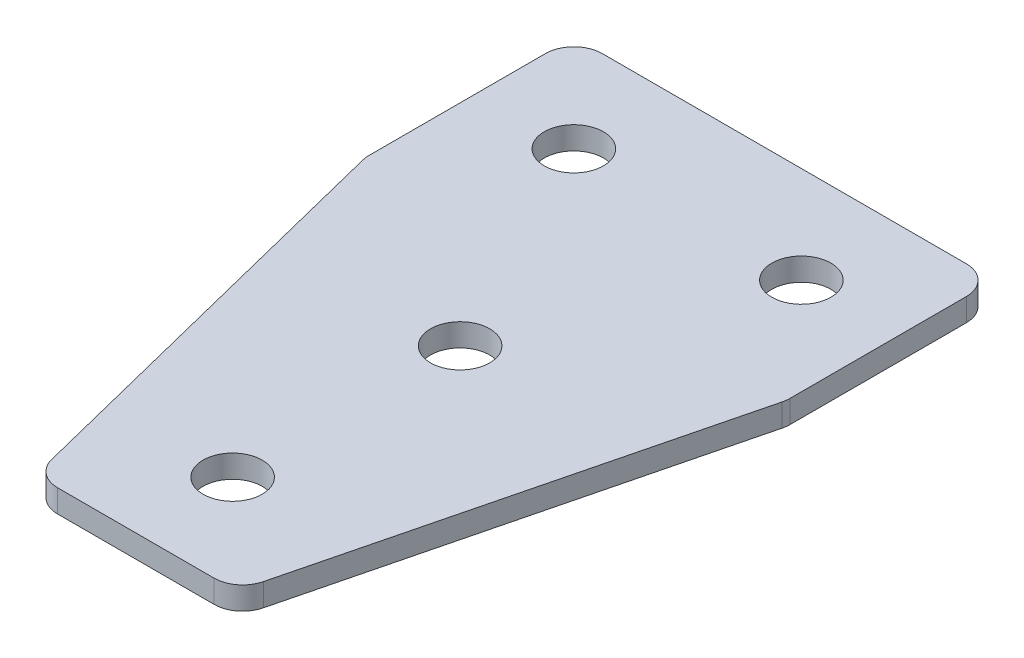
ISO-10303-21;
HEADER;
FILE_DESCRIPTION(('STEP AP214'),'2;1');
FILE_NAME('part.step','',(''),(''),'','','');
FILE_SCHEMA(('AUTOMOTIVE_DESIGN { 1 0 10303 214 1 1 1 1 }'));
ENDSEC;
DATA;
#1=APPLICATION_CONTEXT('core data for automotive mechanical design processes');
#2=APPLICATION_PROTOCOL_DEFINITION('international standard','automotive_design',2000,#1);
#3=PRODUCT_CONTEXT('',#1,'mechanical');
#4=PRODUCT('Part','Part','',(#3));
#5=PRODUCT_RELATED_PRODUCT_CATEGORY('part','',(#4));
#6=PRODUCT_DEFINITION_FORMATION('','',#4);
#7=PRODUCT_DEFINITION_CONTEXT('part definition',#1,'design');
#8=PRODUCT_DEFINITION('design','',#6,#7);
#9=PRODUCT_DEFINITION_SHAPE('','',#8);
#10=(LENGTH_UNIT() NAMED_UNIT(*) SI_UNIT(.MILLI.,.METRE.));
#11=(NAMED_UNIT(*) PLANE_ANGLE_UNIT() SI_UNIT($,.RADIAN.));
#12=(NAMED_UNIT(*) SI_UNIT($,.STERADIAN.) SOLID_ANGLE_UNIT());
#13=UNCERTAINTY_MEASURE_WITH_UNIT(LENGTH_MEASURE(1.E-05),#10,'distance_accuracy_value','');
#14=(GEOMETRIC_REPRESENTATION_CONTEXT(3) GLOBAL_UNCERTAINTY_ASSIGNED_CONTEXT((#13)) GLOBAL_UNIT_ASSIGNED_CONTEXT((#10,
#11,#12)) REPRESENTATION_CONTEXT('',''));
#15=CARTESIAN_POINT('',(0.,0.,0.));
#16=DIRECTION('',(0.,0.,1.));
#17=DIRECTION('',(1.,0.,0.));
#18=AXIS2_PLACEMENT_3D('',#15,#16,#17);
#19=CARTESIAN_POINT('',(-1.37420990733972,1.92462627720624,-21.5499410746997));
#20=DIRECTION('',(0.,-1.,0.));
#21=DIRECTION('',(0.,0.,-1.));
#22=AXIS2_PLACEMENT_3D('',#19,#20,#21);
#23=PLANE('',#22);
#24=CARTESIAN_POINT('',(-1.37420990733973,1.92462627720624,-1.5499410746997));
#25=DIRECTION('',(0.,1.,0.));
#26=DIRECTION('',(0.,0.,1.));
#27=AXIS2_PLACEMENT_3D('',#24,#25,#26);
#28=CIRCLE('',#27,2.6);
#29=CARTESIAN_POINT('',(-1.37420990733973,1.92462627720624,1.0500589253003));
#30=VERTEX_POINT('',#29);
#31=EDGE_CURVE('E147',#30,#30,#28,.T.);
#32=ORIENTED_EDGE('',*,*,#31,.T.);
#33=EDGE_LOOP('',(#32));
#34=FACE_BOUND('',#33,.T.);
#35=DIRECTION('',(1.,0.,0.));
#36=VECTOR('',#35,1.);
#37=CARTESIAN_POINT('',(-9.87420990733978,1.92462627720624,26.9500589253003));
#38=LINE('',#37,#36);
#39=CARTESIAN_POINT('',(-8.2511042817221,1.92462627720624,26.9500589253003));
#40=VERTEX_POINT('',#39);
#41=CARTESIAN_POINT('',(5.50268446704267,1.92462627720624,26.9500589253003));
#42=VERTEX_POINT('',#41);
#43=EDGE_CURVE('E158',#40,#42,#38,.T.);
#44=ORIENTED_EDGE('',*,*,#43,.F.);
#45=CARTESIAN_POINT('',(-8.2511042817221,1.92462627720624,24.4500589253003));
#46=DIRECTION('',(0.,1.,0.));
#47=DIRECTION('',(0.,0.,-1.));
#48=AXIS2_PLACEMENT_3D('',#45,#46,#47);
#49=CIRCLE('',#48,2.5);
#50=CARTESIAN_POINT('',(-10.6764605320854,1.92462627720624,25.0563979878911));
#51=VERTEX_POINT('',#50);
#52=EDGE_CURVE('E215',#51,#40,#49,.T.);
#53=ORIENTED_EDGE('',*,*,#52,.F.);
#54=DIRECTION('',(-0.242535625036331,0.,-0.970142500145332));
#55=VECTOR('',#54,1.);
#56=CARTESIAN_POINT('',(-10.2030452977331,1.92462627720624,26.9500589253003));
#57=LINE('',#56,#55);
#58=CARTESIAN_POINT('',(-19.799566157703,1.92462627720624,-11.4360245145795));
#59=VERTEX_POINT('',#58);
#60=EDGE_CURVE('E218',#51,#59,#57,.T.);
#61=ORIENTED_EDGE('',*,*,#60,.T.);
#62=CARTESIAN_POINT('',(-17.3742099073397,1.92462627720624,-12.0423635771703));
#63=DIRECTION('',(0.,1.,0.));
#64=DIRECTION('',(0.,0.,-1.));
#65=AXIS2_PLACEMENT_3D('',#62,#63,#64);
#66=CIRCLE('',#65,2.5);
#67=CARTESIAN_POINT('',(-19.8742099073396,1.92462627720624,-12.0423635771703));
#68=VERTEX_POINT('',#67);
#69=EDGE_CURVE('E221',#68,#59,#66,.T.);
#70=ORIENTED_EDGE('',*,*,#69,.F.);
#71=DIRECTION('',(0.,0.,-1.));
#72=VECTOR('',#71,1.);
#73=CARTESIAN_POINT('',(-19.8742099073396,1.92462627720624,-11.7345995131262));
#74=LINE('',#73,#72);
#75=CARTESIAN_POINT('',(-19.8742099073397,1.92462627720624,-27.5499410746997));
#76=VERTEX_POINT('',#75);
#77=EDGE_CURVE('E130',#68,#76,#74,.T.);
#78=ORIENTED_EDGE('',*,*,#77,.T.);
#79=CARTESIAN_POINT('',(-17.3742099073397,1.92462627720624,-27.5499410746997));
#80=DIRECTION('',(0.,1.,0.));
#81=DIRECTION('',(0.,0.,-1.));
#82=AXIS2_PLACEMENT_3D('',#79,#80,#81);
#83=CIRCLE('',#82,2.5);
#84=CARTESIAN_POINT('',(-17.3742099073397,1.92462627720624,-30.0499410746997));
#85=VERTEX_POINT('',#84);
#86=EDGE_CURVE('E227',#85,#76,#83,.T.);
#87=ORIENTED_EDGE('',*,*,#86,.F.);
#88=DIRECTION('',(-1.,0.,0.));
#89=VECTOR('',#88,1.);
#90=CARTESIAN_POINT('',(17.1257900926602,1.92462627720624,-30.0499410746997));
#91=LINE('',#90,#89);
#92=CARTESIAN_POINT('',(14.6257900926602,1.92462627720624,-30.0499410746997));
#93=VERTEX_POINT('',#92);
#94=EDGE_CURVE('E134',#93,#85,#91,.T.);
#95=ORIENTED_EDGE('',*,*,#94,.F.);
#96=CARTESIAN_POINT('',(14.6257900926602,1.92462627720624,-27.5499410746997));
#97=DIRECTION('',(0.,-1.,0.));
#98=DIRECTION('',(0.,0.,-1.));
#99=AXIS2_PLACEMENT_3D('',#96,#97,#98);
#100=CIRCLE('',#99,2.5);
#101=CARTESIAN_POINT('',(17.1257900926602,1.92462627720624,-27.5499410746997));
#102=VERTEX_POINT('',#101);
#103=EDGE_CURVE('E179',#93,#102,#100,.T.);
#104=ORIENTED_EDGE('',*,*,#103,.T.);
#105=DIRECTION('',(0.,0.,-1.));
#106=VECTOR('',#105,1.);
#107=CARTESIAN_POINT('',(17.1257900926602,1.92462627720624,-11.7345995131262));
#108=LINE('',#107,#106);
#109=CARTESIAN_POINT('',(17.1257900926602,1.92462627720624,-12.0423635771703));
#110=VERTEX_POINT('',#109);
#111=EDGE_CURVE('E163',#110,#102,#108,.T.);
#112=ORIENTED_EDGE('',*,*,#111,.F.);
#113=CARTESIAN_POINT('',(14.6257900926602,1.92462627720624,-12.0423635771703));
#114=DIRECTION('',(0.,-1.,0.));
#115=DIRECTION('',(0.,0.,-1.));
#116=AXIS2_PLACEMENT_3D('',#113,#114,#115);
#117=CIRCLE('',#116,2.5);
#118=CARTESIAN_POINT('',(17.0511463430236,1.92462627720624,-11.4360245145795));
#119=VERTEX_POINT('',#118);
#120=EDGE_CURVE('E31',#110,#119,#117,.T.);
#121=ORIENTED_EDGE('',*,*,#120,.T.);
#122=DIRECTION('',(0.242535625036331,0.,-0.970142500145332));
#123=VECTOR('',#122,1.);
#124=CARTESIAN_POINT('',(7.45462548305371,1.92462627720624,26.9500589253003));
#125=LINE('',#124,#123);
#126=CARTESIAN_POINT('',(7.928040717406,1.92462627720624,25.0563979878911));
#127=VERTEX_POINT('',#126);
#128=EDGE_CURVE('E161',#127,#119,#125,.T.);
#129=ORIENTED_EDGE('',*,*,#128,.F.);
#130=CARTESIAN_POINT('',(5.50268446704267,1.92462627720624,24.4500589253003));
#131=DIRECTION('',(0.,-1.,0.));
#132=DIRECTION('',(0.,0.,-1.));
#133=AXIS2_PLACEMENT_3D('',#130,#131,#132);
#134=CIRCLE('',#133,2.5);
#135=EDGE_CURVE('E182',#127,#42,#134,.T.);
#136=ORIENTED_EDGE('',*,*,#135,.T.);
#137=EDGE_LOOP('',(#44,#53,#61,#70,#78,#87,#95,#104,#112,#121,#129,#136));
#138=FACE_BOUND('',#137,.T.);
#139=CARTESIAN_POINT('',(-1.37420990733973,1.92462627720624,18.4500589253003));
#140=DIRECTION('',(0.,1.,0.));
#141=DIRECTION('',(0.,0.,1.));
#142=AXIS2_PLACEMENT_3D('',#139,#140,#141);
#143=CIRCLE('',#142,2.6);
#144=CARTESIAN_POINT('',(-1.37420990733973,1.92462627720624,21.0500589253003));
#145=VERTEX_POINT('',#144);
#146=EDGE_CURVE('E139',#145,#145,#143,.T.);
#147=ORIENTED_EDGE('',*,*,#146,.T.);
#148=EDGE_LOOP('',(#147));
#149=FACE_BOUND('',#148,.T.);
#150=CARTESIAN_POINT('',(8.62579009266028,1.92462627720624,-21.5499410746997));
#151=DIRECTION('',(0.,1.,0.));
#152=DIRECTION('',(0.,0.,1.));
#153=AXIS2_PLACEMENT_3D('',#150,#151,#152);
#154=CIRCLE('',#153,2.6);
#155=CARTESIAN_POINT('',(8.62579009266028,1.92462627720624,-18.9499410746997));
#156=VERTEX_POINT('',#155);
#157=EDGE_CURVE('E119',#156,#156,#154,.T.);
#158=ORIENTED_EDGE('',*,*,#157,.T.);
#159=EDGE_LOOP('',(#158));
#160=FACE_BOUND('',#159,.T.);
#161=CARTESIAN_POINT('',(-11.3742099073397,1.92462627720624,-21.5499410746997));
#162=DIRECTION('',(0.,-1.,0.));
#163=DIRECTION('',(0.,0.,1.));
#164=AXIS2_PLACEMENT_3D('',#161,#162,#163);
#165=CIRCLE('',#164,2.6);
#166=CARTESIAN_POINT('',(-11.3742099073397,1.92462627720624,-18.9499410746997));
#167=VERTEX_POINT('',#166);
#168=EDGE_CURVE('E248',#167,#167,#165,.T.);
#169=ORIENTED_EDGE('',*,*,#168,.F.);
#170=EDGE_LOOP('',(#169));
#171=FACE_BOUND('',#170,.T.);
#172=ADVANCED_FACE('F16',(#34,#138,#149,#160,#171),#23,.T.);
#173=CARTESIAN_POINT('',(17.1257900926602,1.92462627720624,-30.0499410746997));
#174=DIRECTION('',(0.,0.,-1.));
#175=DIRECTION('',(-1.,0.,0.));
#176=AXIS2_PLACEMENT_3D('',#173,#174,#175);
#177=PLANE('',#176);
#178=ORIENTED_EDGE('',*,*,#94,.T.);
#179=DIRECTION('',(0.,1.,0.));
#180=VECTOR('',#179,1.);
#181=CARTESIAN_POINT('',(-17.3742099073397,1.92462627720624,-30.0499410746997));
#182=LINE('',#181,#180);
#183=CARTESIAN_POINT('',(-17.3742099073397,3.92462627720624,-30.0499410746997));
#184=VERTEX_POINT('',#183);
#185=EDGE_CURVE('E125',#184,#85,#182,.F.);
#186=ORIENTED_EDGE('',*,*,#185,.F.);
#187=DIRECTION('',(-1.,0.,0.));
#188=VECTOR('',#187,1.);
#189=CARTESIAN_POINT('',(17.1257900926602,3.92462627720624,-30.0499410746997));
#190=LINE('',#189,#188);
#191=CARTESIAN_POINT('',(14.6257900926602,3.92462627720624,-30.0499410746997));
#192=VERTEX_POINT('',#191);
#193=EDGE_CURVE('E105',#192,#184,#190,.T.);
#194=ORIENTED_EDGE('',*,*,#193,.F.);
#195=DIRECTION('',(0.,1.,0.));
#196=VECTOR('',#195,1.);
#197=CARTESIAN_POINT('',(14.6257900926602,1.92462627720624,-30.0499410746997));
#198=LINE('',#197,#196);
#199=EDGE_CURVE('E10',#192,#93,#198,.F.);
#200=ORIENTED_EDGE('',*,*,#199,.T.);
#201=EDGE_LOOP('',(#178,#186,#194,#200));
#202=FACE_BOUND('',#201,.T.);
#203=ADVANCED_FACE('F132',(#202),#177,.T.);
#204=CARTESIAN_POINT('',(17.1257900926602,1.92462627720624,-11.7345995131262));
#205=DIRECTION('',(1.,0.,0.));
#206=DIRECTION('',(0.,0.,-1.));
#207=AXIS2_PLACEMENT_3D('',#204,#205,#206);
#208=PLANE('',#207);
#209=DIRECTION('',(0.,0.,-1.));
#210=VECTOR('',#209,1.);
#211=CARTESIAN_POINT('',(17.1257900926602,3.92462627720624,-11.7345995131262));
#212=LINE('',#211,#210);
#213=CARTESIAN_POINT('',(17.1257900926602,3.92462627720624,-12.0423635771703));
#214=VERTEX_POINT('',#213);
#215=CARTESIAN_POINT('',(17.1257900926602,3.92462627720624,-27.5499410746997));
#216=VERTEX_POINT('',#215);
#217=EDGE_CURVE('E159',#214,#216,#212,.T.);
#218=ORIENTED_EDGE('',*,*,#217,.F.);
#219=DIRECTION('',(0.,1.,0.));
#220=VECTOR('',#219,1.);
#221=CARTESIAN_POINT('',(17.1257900926602,1.92462627720624,-12.0423635771703));
#222=LINE('',#221,#220);
#223=EDGE_CURVE('E24',#214,#110,#222,.F.);
#224=ORIENTED_EDGE('',*,*,#223,.T.);
#225=ORIENTED_EDGE('',*,*,#111,.T.);
#226=DIRECTION('',(0.,1.,0.));
#227=VECTOR('',#226,1.);
#228=CARTESIAN_POINT('',(17.1257900926602,1.92462627720624,-27.5499410746997));
#229=LINE('',#228,#227);
#230=EDGE_CURVE('E189',#102,#216,#229,.T.);
#231=ORIENTED_EDGE('',*,*,#230,.T.);
#232=EDGE_LOOP('',(#218,#224,#225,#231));
#233=FACE_BOUND('',#232,.T.);
#234=ADVANCED_FACE('F194',(#233),#208,.T.);
#235=CARTESIAN_POINT('',(7.45462548305371,1.92462627720624,26.9500589253003));
#236=DIRECTION('',(0.970142500145333,0.,0.242535625036331));
#237=DIRECTION('',(0.242535625036331,0.,-0.970142500145333));
#238=AXIS2_PLACEMENT_3D('',#235,#236,#237);
#239=PLANE('',#238);
#240=DIRECTION('',(0.242535625036331,0.,-0.970142500145332));
#241=VECTOR('',#240,1.);
#242=CARTESIAN_POINT('',(7.45462548305371,3.92462627720624,26.9500589253003));
#243=LINE('',#242,#241);
#244=CARTESIAN_POINT('',(7.928040717406,3.92462627720624,25.0563979878911));
#245=VERTEX_POINT('',#244);
#246=CARTESIAN_POINT('',(17.0511463430236,3.92462627720624,-11.4360245145795));
#247=VERTEX_POINT('',#246);
#248=EDGE_CURVE('E167',#245,#247,#243,.T.);
#249=ORIENTED_EDGE('',*,*,#248,.F.);
#250=DIRECTION('',(0.,1.,0.));
#251=VECTOR('',#250,1.);
#252=CARTESIAN_POINT('',(7.928040717406,1.92462627720624,25.0563979878911));
#253=LINE('',#252,#251);
#254=EDGE_CURVE('E38',#245,#127,#253,.F.);
#255=ORIENTED_EDGE('',*,*,#254,.T.);
#256=ORIENTED_EDGE('',*,*,#128,.T.);
#257=DIRECTION('',(0.,1.,0.));
#258=VECTOR('',#257,1.);
#259=CARTESIAN_POINT('',(17.0511463430236,1.92462627720624,-11.4360245145795));
#260=LINE('',#259,#258);
#261=EDGE_CURVE('E185',#119,#247,#260,.T.);
#262=ORIENTED_EDGE('',*,*,#261,.T.);
#263=EDGE_LOOP('',(#249,#255,#256,#262));
#264=FACE_BOUND('',#263,.T.);
#265=ADVANCED_FACE('F201',(#264),#239,.T.);
#266=CARTESIAN_POINT('',(-9.87420990733978,1.92462627720624,26.9500589253003));
#267=DIRECTION('',(0.,0.,1.));
#268=DIRECTION('',(1.,0.,0.));
#269=AXIS2_PLACEMENT_3D('',#266,#267,#268);
#270=PLANE('',#269);
#271=DIRECTION('',(1.,0.,0.));
#272=VECTOR('',#271,1.);
#273=CARTESIAN_POINT('',(-9.87420990733978,3.92462627720624,26.9500589253003));
#274=LINE('',#273,#272);
#275=CARTESIAN_POINT('',(-8.2511042817221,3.92462627720624,26.9500589253003));
#276=VERTEX_POINT('',#275);
#277=CARTESIAN_POINT('',(5.50268446704267,3.92462627720624,26.9500589253003));
#278=VERTEX_POINT('',#277);
#279=EDGE_CURVE('E118',#276,#278,#274,.T.);
#280=ORIENTED_EDGE('',*,*,#279,.F.);
#281=DIRECTION('',(0.,1.,0.));
#282=VECTOR('',#281,1.);
#283=CARTESIAN_POINT('',(-8.2511042817221,1.92462627720624,26.9500589253003));
#284=LINE('',#283,#282);
#285=EDGE_CURVE('E211',#40,#276,#284,.T.);
#286=ORIENTED_EDGE('',*,*,#285,.F.);
#287=ORIENTED_EDGE('',*,*,#43,.T.);
#288=DIRECTION('',(0.,1.,0.));
#289=VECTOR('',#288,1.);
#290=CARTESIAN_POINT('',(5.50268446704267,1.92462627720624,26.9500589253003));
#291=LINE('',#290,#289);
#292=EDGE_CURVE('E176',#42,#278,#291,.T.);
#293=ORIENTED_EDGE('',*,*,#292,.T.);
#294=EDGE_LOOP('',(#280,#286,#287,#293));
#295=FACE_BOUND('',#294,.T.);
#296=ADVANCED_FACE('F208',(#295),#270,.T.);
#297=CARTESIAN_POINT('',(-1.37420990733972,3.92462627720624,-21.5499410746997));
#298=DIRECTION('',(0.,-1.,0.));
#299=DIRECTION('',(0.,0.,-1.));
#300=AXIS2_PLACEMENT_3D('',#297,#298,#299);
#301=PLANE('',#300);
#302=CARTESIAN_POINT('',(-1.37420990733973,3.92462627720624,-1.5499410746997));
#303=DIRECTION('',(0.,1.,0.));
#304=DIRECTION('',(0.,0.,1.));
#305=AXIS2_PLACEMENT_3D('',#302,#303,#304);
#306=CIRCLE('',#305,2.6);
#307=CARTESIAN_POINT('',(-1.37420990733973,3.92462627720624,1.0500589253003));
#308=VERTEX_POINT('',#307);
#309=EDGE_CURVE('E145',#308,#308,#306,.T.);
#310=ORIENTED_EDGE('',*,*,#309,.F.);
#311=EDGE_LOOP('',(#310));
#312=FACE_BOUND('',#311,.T.);
#313=CARTESIAN_POINT('',(-8.2511042817221,3.92462627720624,24.4500589253003));
#314=DIRECTION('',(0.,1.,0.));
#315=DIRECTION('',(0.,0.,-1.));
#316=AXIS2_PLACEMENT_3D('',#313,#314,#315);
#317=CIRCLE('',#316,2.5);
#318=CARTESIAN_POINT('',(-10.6764605320854,3.92462627720624,25.0563979878911));
#319=VERTEX_POINT('',#318);
#320=EDGE_CURVE('E233',#276,#319,#317,.F.);
#321=ORIENTED_EDGE('',*,*,#320,.F.);
#322=ORIENTED_EDGE('',*,*,#279,.T.);
#323=CARTESIAN_POINT('',(5.50268446704267,3.92462627720624,24.4500589253003));
#324=DIRECTION('',(0.,-1.,0.));
#325=DIRECTION('',(0.,0.,-1.));
#326=AXIS2_PLACEMENT_3D('',#323,#324,#325);
#327=CIRCLE('',#326,2.5);
#328=EDGE_CURVE('E174',#278,#245,#327,.F.);
#329=ORIENTED_EDGE('',*,*,#328,.T.);
#330=ORIENTED_EDGE('',*,*,#248,.T.);
#331=CARTESIAN_POINT('',(14.6257900926602,3.92462627720624,-12.0423635771703));
#332=DIRECTION('',(0.,-1.,0.));
#333=DIRECTION('',(0.,0.,-1.));
#334=AXIS2_PLACEMENT_3D('',#331,#332,#333);
#335=CIRCLE('',#334,2.5);
#336=EDGE_CURVE('E172',#247,#214,#335,.F.);
#337=ORIENTED_EDGE('',*,*,#336,.T.);
#338=ORIENTED_EDGE('',*,*,#217,.T.);
#339=CARTESIAN_POINT('',(14.6257900926602,3.92462627720624,-27.5499410746997));
#340=DIRECTION('',(0.,-1.,0.));
#341=DIRECTION('',(0.,0.,-1.));
#342=AXIS2_PLACEMENT_3D('',#339,#340,#341);
#343=CIRCLE('',#342,2.5);
#344=EDGE_CURVE('E114',#216,#192,#343,.F.);
#345=ORIENTED_EDGE('',*,*,#344,.T.);
#346=ORIENTED_EDGE('',*,*,#193,.T.);
#347=CARTESIAN_POINT('',(-17.3742099073397,3.92462627720624,-27.5499410746997));
#348=DIRECTION('',(0.,1.,0.));
#349=DIRECTION('',(0.,0.,-1.));
#350=AXIS2_PLACEMENT_3D('',#347,#348,#349);
#351=CIRCLE('',#350,2.5);
#352=CARTESIAN_POINT('',(-19.8742099073397,3.92462627720624,-27.5499410746997));
#353=VERTEX_POINT('',#352);
#354=EDGE_CURVE('E111',#353,#184,#351,.F.);
#355=ORIENTED_EDGE('',*,*,#354,.F.);
#356=DIRECTION('',(0.,0.,-1.));
#357=VECTOR('',#356,1.);
#358=CARTESIAN_POINT('',(-19.8742099073396,3.92462627720624,-11.7345995131262));
#359=LINE('',#358,#357);
#360=CARTESIAN_POINT('',(-19.8742099073396,3.92462627720624,-12.0423635771703));
#361=VERTEX_POINT('',#360);
#362=EDGE_CURVE('E238',#361,#353,#359,.T.);
#363=ORIENTED_EDGE('',*,*,#362,.F.);
#364=CARTESIAN_POINT('',(-17.3742099073397,3.92462627720624,-12.0423635771703));
#365=DIRECTION('',(0.,1.,0.));
#366=DIRECTION('',(0.,0.,-1.));
#367=AXIS2_PLACEMENT_3D('',#364,#365,#366);
#368=CIRCLE('',#367,2.5);
#369=CARTESIAN_POINT('',(-19.799566157703,3.92462627720624,-11.4360245145795));
#370=VERTEX_POINT('',#369);
#371=EDGE_CURVE('E129',#370,#361,#368,.F.);
#372=ORIENTED_EDGE('',*,*,#371,.F.);
#373=DIRECTION('',(-0.242535625036331,0.,-0.970142500145332));
#374=VECTOR('',#373,1.);
#375=CARTESIAN_POINT('',(-10.2030452977331,3.92462627720624,26.9500589253003));
#376=LINE('',#375,#374);
#377=EDGE_CURVE('E242',#319,#370,#376,.T.);
#378=ORIENTED_EDGE('',*,*,#377,.F.);
#379=EDGE_LOOP('',(#321,#322,#329,#330,#337,#338,#345,#346,#355,#363,#372,#378));
#380=FACE_BOUND('',#379,.T.);
#381=CARTESIAN_POINT('',(-1.37420990733973,3.92462627720624,18.4500589253003));
#382=DIRECTION('',(0.,1.,0.));
#383=DIRECTION('',(0.,0.,1.));
#384=AXIS2_PLACEMENT_3D('',#381,#382,#383);
#385=CIRCLE('',#384,2.6);
#386=CARTESIAN_POINT('',(-1.37420990733973,3.92462627720624,21.0500589253003));
#387=VERTEX_POINT('',#386);
#388=EDGE_CURVE('E135',#387,#387,#385,.T.);
#389=ORIENTED_EDGE('',*,*,#388,.F.);
#390=EDGE_LOOP('',(#389));
#391=FACE_BOUND('',#390,.T.);
#392=CARTESIAN_POINT('',(8.62579009266028,3.92462627720624,-21.5499410746997));
#393=DIRECTION('',(0.,1.,0.));
#394=DIRECTION('',(0.,0.,1.));
#395=AXIS2_PLACEMENT_3D('',#392,#393,#394);
#396=CIRCLE('',#395,2.6);
#397=CARTESIAN_POINT('',(8.62579009266028,3.92462627720624,-18.9499410746997));
#398=VERTEX_POINT('',#397);
#399=EDGE_CURVE('E150',#398,#398,#396,.T.);
#400=ORIENTED_EDGE('',*,*,#399,.F.);
#401=EDGE_LOOP('',(#400));
#402=FACE_BOUND('',#401,.T.);
#403=CARTESIAN_POINT('',(-11.3742099073397,3.92462627720624,-21.5499410746997));
#404=DIRECTION('',(0.,-1.,0.));
#405=DIRECTION('',(0.,0.,1.));
#406=AXIS2_PLACEMENT_3D('',#403,#404,#405);
#407=CIRCLE('',#406,2.6);
#408=CARTESIAN_POINT('',(-11.3742099073397,3.92462627720624,-18.9499410746997));
#409=VERTEX_POINT('',#408);
#410=EDGE_CURVE('E245',#409,#409,#407,.T.);
#411=ORIENTED_EDGE('',*,*,#410,.T.);
#412=EDGE_LOOP('',(#411));
#413=FACE_BOUND('',#412,.T.);
#414=ADVANCED_FACE('F108',(#312,#380,#391,#402,#413),#301,.F.);
#415=CARTESIAN_POINT('',(5.50268446704267,1.92462627720624,24.4500589253003));
#416=DIRECTION('',(0.,1.,0.));
#417=DIRECTION('',(0.,0.,1.));
#418=AXIS2_PLACEMENT_3D('',#415,#416,#417);
#419=CYLINDRICAL_SURFACE('',#418,2.5);
#420=ORIENTED_EDGE('',*,*,#135,.F.);
#421=ORIENTED_EDGE('',*,*,#254,.F.);
#422=ORIENTED_EDGE('',*,*,#328,.F.);
#423=ORIENTED_EDGE('',*,*,#292,.F.);
#424=EDGE_LOOP('',(#420,#421,#422,#423));
#425=FACE_BOUND('',#424,.T.);
#426=ADVANCED_FACE('F206',(#425),#419,.T.);
#427=CARTESIAN_POINT('',(14.6257900926602,1.92462627720624,-12.0423635771703));
#428=DIRECTION('',(0.,1.,0.));
#429=DIRECTION('',(0.,0.,1.));
#430=AXIS2_PLACEMENT_3D('',#427,#428,#429);
#431=CYLINDRICAL_SURFACE('',#430,2.5);
#432=ORIENTED_EDGE('',*,*,#120,.F.);
#433=ORIENTED_EDGE('',*,*,#223,.F.);
#434=ORIENTED_EDGE('',*,*,#336,.F.);
#435=ORIENTED_EDGE('',*,*,#261,.F.);
#436=EDGE_LOOP('',(#432,#433,#434,#435));
#437=FACE_BOUND('',#436,.T.);
#438=ADVANCED_FACE('F200',(#437),#431,.T.);
#439=CARTESIAN_POINT('',(14.6257900926602,1.92462627720624,-27.5499410746997));
#440=DIRECTION('',(0.,1.,0.));
#441=DIRECTION('',(0.,0.,1.));
#442=AXIS2_PLACEMENT_3D('',#439,#440,#441);
#443=CYLINDRICAL_SURFACE('',#442,2.5);
#444=ORIENTED_EDGE('',*,*,#103,.F.);
#445=ORIENTED_EDGE('',*,*,#199,.F.);
#446=ORIENTED_EDGE('',*,*,#344,.F.);
#447=ORIENTED_EDGE('',*,*,#230,.F.);
#448=EDGE_LOOP('',(#444,#445,#446,#447));
#449=FACE_BOUND('',#448,.T.);
#450=ADVANCED_FACE('F18',(#449),#443,.T.);
#451=CARTESIAN_POINT('',(8.62579009266028,1.92462627720624,-21.5499410746997));
#452=DIRECTION('',(0.,1.,0.));
#453=DIRECTION('',(0.,0.,1.));
#454=AXIS2_PLACEMENT_3D('',#451,#452,#453);
#455=CYLINDRICAL_SURFACE('',#454,2.6);
#456=ORIENTED_EDGE('',*,*,#157,.F.);
#457=EDGE_LOOP('',(#456));
#458=FACE_BOUND('',#457,.T.);
#459=ORIENTED_EDGE('',*,*,#399,.T.);
#460=EDGE_LOOP('',(#459));
#461=FACE_BOUND('',#460,.T.);
#462=ADVANCED_FACE('F282',(#458,#461),#455,.F.);
#463=CARTESIAN_POINT('',(-1.37420990733973,1.92462627720624,-1.5499410746997));
#464=DIRECTION('',(0.,1.,0.));
#465=DIRECTION('',(0.,0.,1.));
#466=AXIS2_PLACEMENT_3D('',#463,#464,#465);
#467=CYLINDRICAL_SURFACE('',#466,2.6);
#468=ORIENTED_EDGE('',*,*,#31,.F.);
#469=EDGE_LOOP('',(#468));
#470=FACE_BOUND('',#469,.T.);
#471=ORIENTED_EDGE('',*,*,#309,.T.);
#472=EDGE_LOOP('',(#471));
#473=FACE_BOUND('',#472,.T.);
#474=ADVANCED_FACE('F287',(#470,#473),#467,.F.);
#475=CARTESIAN_POINT('',(-1.37420990733973,1.92462627720624,18.4500589253003));
#476=DIRECTION('',(0.,1.,0.));
#477=DIRECTION('',(0.,0.,1.));
#478=AXIS2_PLACEMENT_3D('',#475,#476,#477);
#479=CYLINDRICAL_SURFACE('',#478,2.6);
#480=ORIENTED_EDGE('',*,*,#388,.T.);
#481=EDGE_LOOP('',(#480));
#482=FACE_BOUND('',#481,.T.);
#483=ORIENTED_EDGE('',*,*,#146,.F.);
#484=EDGE_LOOP('',(#483));
#485=FACE_BOUND('',#484,.T.);
#486=ADVANCED_FACE('F293',(#482,#485),#479,.F.);
#487=CARTESIAN_POINT('',(-19.8742099073396,1.92462627720624,-11.7345995131262));
#488=DIRECTION('',(-1.,0.,0.));
#489=DIRECTION('',(0.,0.,-1.));
#490=AXIS2_PLACEMENT_3D('',#487,#488,#489);
#491=PLANE('',#490);
#492=ORIENTED_EDGE('',*,*,#362,.T.);
#493=DIRECTION('',(0.,1.,0.));
#494=VECTOR('',#493,1.);
#495=CARTESIAN_POINT('',(-19.8742099073397,1.92462627720624,-27.5499410746997));
#496=LINE('',#495,#494);
#497=EDGE_CURVE('E127',#76,#353,#496,.T.);
#498=ORIENTED_EDGE('',*,*,#497,.F.);
#499=ORIENTED_EDGE('',*,*,#77,.F.);
#500=DIRECTION('',(0.,1.,0.));
#501=VECTOR('',#500,1.);
#502=CARTESIAN_POINT('',(-19.8742099073396,1.92462627720624,-12.0423635771703));
#503=LINE('',#502,#501);
#504=EDGE_CURVE('E136',#361,#68,#503,.F.);
#505=ORIENTED_EDGE('',*,*,#504,.F.);
#506=EDGE_LOOP('',(#492,#498,#499,#505));
#507=FACE_BOUND('',#506,.T.);
#508=ADVANCED_FACE('F255',(#507),#491,.T.);
#509=CARTESIAN_POINT('',(-10.2030452977331,1.92462627720624,26.9500589253003));
#510=DIRECTION('',(-0.970142500145333,0.,0.242535625036331));
#511=DIRECTION('',(-0.242535625036331,0.,-0.970142500145333));
#512=AXIS2_PLACEMENT_3D('',#509,#510,#511);
#513=PLANE('',#512);
#514=ORIENTED_EDGE('',*,*,#377,.T.);
#515=DIRECTION('',(0.,1.,0.));
#516=VECTOR('',#515,1.);
#517=CARTESIAN_POINT('',(-19.799566157703,1.92462627720624,-11.4360245145795));
#518=LINE('',#517,#516);
#519=EDGE_CURVE('E220',#59,#370,#518,.T.);
#520=ORIENTED_EDGE('',*,*,#519,.F.);
#521=ORIENTED_EDGE('',*,*,#60,.F.);
#522=DIRECTION('',(0.,1.,0.));
#523=VECTOR('',#522,1.);
#524=CARTESIAN_POINT('',(-10.6764605320854,1.92462627720624,25.0563979878911));
#525=LINE('',#524,#523);
#526=EDGE_CURVE('E224',#319,#51,#525,.F.);
#527=ORIENTED_EDGE('',*,*,#526,.F.);
#528=EDGE_LOOP('',(#514,#520,#521,#527));
#529=FACE_BOUND('',#528,.T.);
#530=ADVANCED_FACE('F237',(#529),#513,.T.);
#531=CARTESIAN_POINT('',(-8.2511042817221,1.92462627720624,24.4500589253003));
#532=DIRECTION('',(0.,1.,0.));
#533=DIRECTION('',(0.,0.,1.));
#534=AXIS2_PLACEMENT_3D('',#531,#532,#533);
#535=CYLINDRICAL_SURFACE('',#534,2.5);
#536=ORIENTED_EDGE('',*,*,#52,.T.);
#537=ORIENTED_EDGE('',*,*,#285,.T.);
#538=ORIENTED_EDGE('',*,*,#320,.T.);
#539=ORIENTED_EDGE('',*,*,#526,.T.);
#540=EDGE_LOOP('',(#536,#537,#538,#539));
#541=FACE_BOUND('',#540,.T.);
#542=ADVANCED_FACE('F232',(#541),#535,.T.);
#543=CARTESIAN_POINT('',(-17.3742099073397,1.92462627720624,-12.0423635771703));
#544=DIRECTION('',(0.,1.,0.));
#545=DIRECTION('',(0.,0.,1.));
#546=AXIS2_PLACEMENT_3D('',#543,#544,#545);
#547=CYLINDRICAL_SURFACE('',#546,2.5);
#548=ORIENTED_EDGE('',*,*,#69,.T.);
#549=ORIENTED_EDGE('',*,*,#519,.T.);
#550=ORIENTED_EDGE('',*,*,#371,.T.);
#551=ORIENTED_EDGE('',*,*,#504,.T.);
#552=EDGE_LOOP('',(#548,#549,#550,#551));
#553=FACE_BOUND('',#552,.T.);
#554=ADVANCED_FACE('F257',(#553),#547,.T.);
#555=CARTESIAN_POINT('',(-17.3742099073397,1.92462627720624,-27.5499410746997));
#556=DIRECTION('',(0.,1.,0.));
#557=DIRECTION('',(0.,0.,1.));
#558=AXIS2_PLACEMENT_3D('',#555,#556,#557);
#559=CYLINDRICAL_SURFACE('',#558,2.5);
#560=ORIENTED_EDGE('',*,*,#86,.T.);
#561=ORIENTED_EDGE('',*,*,#497,.T.);
#562=ORIENTED_EDGE('',*,*,#354,.T.);
#563=ORIENTED_EDGE('',*,*,#185,.T.);
#564=EDGE_LOOP('',(#560,#561,#562,#563));
#565=FACE_BOUND('',#564,.T.);
#566=ADVANCED_FACE('F124',(#565),#559,.T.);
#567=CARTESIAN_POINT('',(-11.3742099073397,1.92462627720624,-21.5499410746997));
#568=DIRECTION('',(0.,1.,0.));
#569=DIRECTION('',(0.,0.,1.));
#570=AXIS2_PLACEMENT_3D('',#567,#568,#569);
#571=CYLINDRICAL_SURFACE('',#570,2.6);
#572=ORIENTED_EDGE('',*,*,#168,.T.);
#573=EDGE_LOOP('',(#572));
#574=FACE_BOUND('',#573,.T.);
#575=ORIENTED_EDGE('',*,*,#410,.F.);
#576=EDGE_LOOP('',(#575));
#577=FACE_BOUND('',#576,.T.);
#578=ADVANCED_FACE('F265',(#574,#577),#571,.F.);
#579=CLOSED_SHELL('',(#172,#203,#234,#265,#296,#414,#426,#438,#450,#462,#474,#486,#508,#530,
#542,#554,#566,#578));
#580=MANIFOLD_SOLID_BREP('B1',#579);
#581=ADVANCED_BREP_SHAPE_REPRESENTATION('',(#18,#580),#14);
#582=SHAPE_DEFINITION_REPRESENTATION(#9,#581);
ENDSEC;
END-ISO-10303-21;
